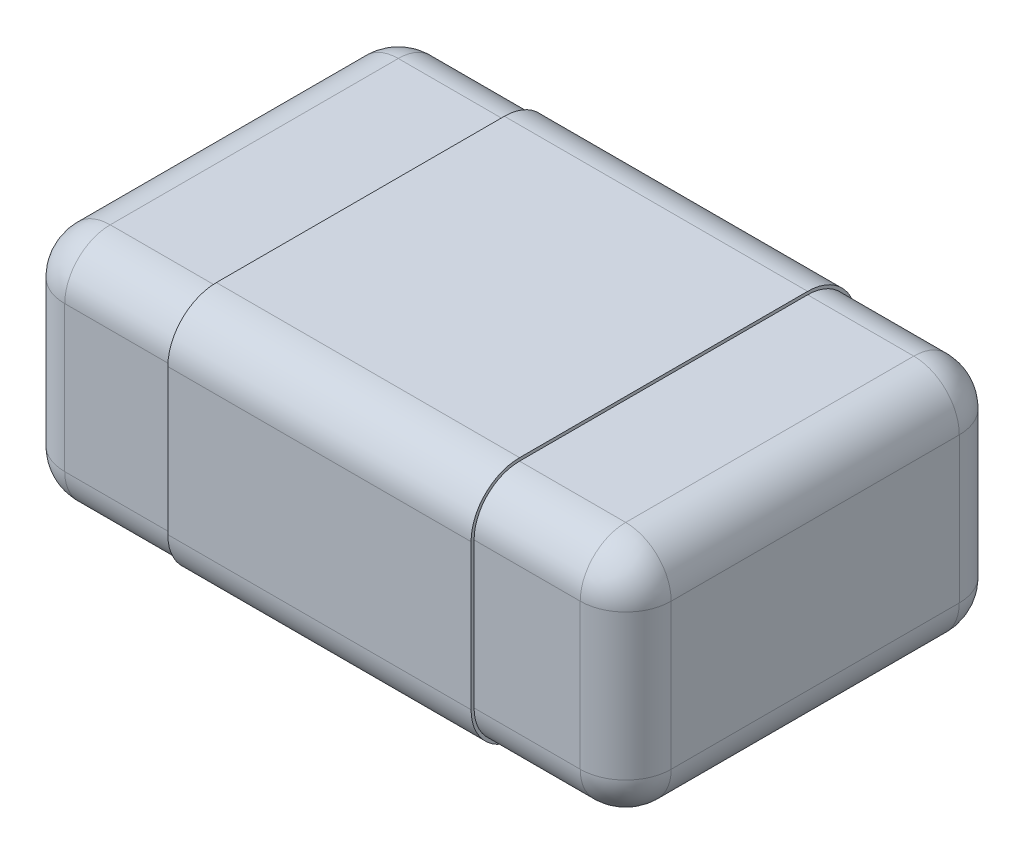
ISO-10303-21;
HEADER;
FILE_DESCRIPTION(('STEP AP214'),'2;1');
FILE_NAME('part.step','',(''),(''),'','','');
FILE_SCHEMA(('AUTOMOTIVE_DESIGN { 1 0 10303 214 1 1 1 1 }'));
ENDSEC;
DATA;
#1=APPLICATION_CONTEXT('core data for automotive mechanical design processes');
#2=APPLICATION_PROTOCOL_DEFINITION('international standard','automotive_design',2000,#1);
#3=PRODUCT_CONTEXT('',#1,'mechanical');
#4=PRODUCT('Part','Part','',(#3));
#5=PRODUCT_RELATED_PRODUCT_CATEGORY('part','',(#4));
#6=PRODUCT_DEFINITION_FORMATION('','',#4);
#7=PRODUCT_DEFINITION_CONTEXT('part definition',#1,'design');
#8=PRODUCT_DEFINITION('design','',#6,#7);
#9=PRODUCT_DEFINITION_SHAPE('','',#8);
#10=(LENGTH_UNIT() NAMED_UNIT(*) SI_UNIT(.MILLI.,.METRE.));
#11=(NAMED_UNIT(*) PLANE_ANGLE_UNIT() SI_UNIT($,.RADIAN.));
#12=(NAMED_UNIT(*) SI_UNIT($,.STERADIAN.) SOLID_ANGLE_UNIT());
#13=UNCERTAINTY_MEASURE_WITH_UNIT(LENGTH_MEASURE(1.E-05),#10,'distance_accuracy_value','');
#14=(GEOMETRIC_REPRESENTATION_CONTEXT(3) GLOBAL_UNCERTAINTY_ASSIGNED_CONTEXT((#13)) GLOBAL_UNIT_ASSIGNED_CONTEXT((#10,
#11,#12)) REPRESENTATION_CONTEXT('',''));
#15=CARTESIAN_POINT('',(0.,0.,0.));
#16=DIRECTION('',(0.,0.,1.));
#17=DIRECTION('',(1.,0.,0.));
#18=AXIS2_PLACEMENT_3D('',#15,#16,#17);
#19=CARTESIAN_POINT('',(-0.5,-0.63,-0.475));
#20=DIRECTION('',(1.,0.,0.));
#21=DIRECTION('',(0.,0.,-1.));
#22=AXIS2_PLACEMENT_3D('',#19,#20,#21);
#23=CYLINDRICAL_SURFACE('',#22,0.16);
#24=DIRECTION('',(1.,0.,0.));
#25=VECTOR('',#24,1.);
#26=CARTESIAN_POINT('',(-0.5,-0.63,-0.635));
#27=LINE('',#26,#25);
#28=CARTESIAN_POINT('',(-0.5,-0.63,-0.635));
#29=VERTEX_POINT('',#28);
#30=CARTESIAN_POINT('',(0.5,-0.63,-0.635));
#31=VERTEX_POINT('',#30);
#32=EDGE_CURVE('E324',#29,#31,#27,.T.);
#33=ORIENTED_EDGE('',*,*,#32,.T.);
#34=CARTESIAN_POINT('',(0.5,-0.63,-0.475));
#35=DIRECTION('',(1.,0.,0.));
#36=DIRECTION('',(0.,0.,-1.));
#37=AXIS2_PLACEMENT_3D('',#34,#35,#36);
#38=CIRCLE('',#37,0.16);
#39=CARTESIAN_POINT('',(0.5,-0.79,-0.475));
#40=VERTEX_POINT('',#39);
#41=EDGE_CURVE('E244',#40,#31,#38,.T.);
#42=ORIENTED_EDGE('',*,*,#41,.F.);
#43=DIRECTION('',(1.,0.,0.));
#44=VECTOR('',#43,1.);
#45=CARTESIAN_POINT('',(-0.5,-0.79,-0.475));
#46=LINE('',#45,#44);
#47=CARTESIAN_POINT('',(-0.5,-0.79,-0.475));
#48=VERTEX_POINT('',#47);
#49=EDGE_CURVE('E325',#48,#40,#46,.T.);
#50=ORIENTED_EDGE('',*,*,#49,.F.);
#51=CARTESIAN_POINT('',(-0.5,-0.63,-0.475));
#52=DIRECTION('',(1.,0.,0.));
#53=DIRECTION('',(0.,0.,-1.));
#54=AXIS2_PLACEMENT_3D('',#51,#52,#53);
#55=CIRCLE('',#54,0.16);
#56=EDGE_CURVE('E300',#48,#29,#55,.T.);
#57=ORIENTED_EDGE('',*,*,#56,.T.);
#58=EDGE_LOOP('',(#33,#42,#50,#57));
#59=FACE_BOUND('',#58,.T.);
#60=ADVANCED_FACE('F33',(#59),#23,.T.);
#61=CARTESIAN_POINT('',(-0.5,-0.79,-0.475));
#62=DIRECTION('',(0.,-1.,0.));
#63=DIRECTION('',(0.,0.,-1.));
#64=AXIS2_PLACEMENT_3D('',#61,#62,#63);
#65=PLANE('',#64);
#66=ORIENTED_EDGE('',*,*,#49,.T.);
#67=DIRECTION('',(0.,0.,-1.));
#68=VECTOR('',#67,1.);
#69=CARTESIAN_POINT('',(0.5,-0.79,-0.475));
#70=LINE('',#69,#68);
#71=CARTESIAN_POINT('',(0.5,-0.79,0.475));
#72=VERTEX_POINT('',#71);
#73=EDGE_CURVE('E281',#72,#40,#70,.T.);
#74=ORIENTED_EDGE('',*,*,#73,.F.);
#75=DIRECTION('',(1.,0.,0.));
#76=VECTOR('',#75,1.);
#77=CARTESIAN_POINT('',(-0.5,-0.79,0.475));
#78=LINE('',#77,#76);
#79=CARTESIAN_POINT('',(-0.5,-0.79,0.475));
#80=VERTEX_POINT('',#79);
#81=EDGE_CURVE('E328',#80,#72,#78,.T.);
#82=ORIENTED_EDGE('',*,*,#81,.F.);
#83=DIRECTION('',(0.,0.,-1.));
#84=VECTOR('',#83,1.);
#85=CARTESIAN_POINT('',(-0.5,-0.79,-0.475));
#86=LINE('',#85,#84);
#87=EDGE_CURVE('E321',#80,#48,#86,.T.);
#88=ORIENTED_EDGE('',*,*,#87,.T.);
#89=EDGE_LOOP('',(#66,#74,#82,#88));
#90=FACE_BOUND('',#89,.T.);
#91=ADVANCED_FACE('F554',(#90),#65,.T.);
#92=CARTESIAN_POINT('',(-0.5,-0.63,0.475));
#93=DIRECTION('',(1.,0.,0.));
#94=DIRECTION('',(0.,0.,-1.));
#95=AXIS2_PLACEMENT_3D('',#92,#93,#94);
#96=CYLINDRICAL_SURFACE('',#95,0.16);
#97=ORIENTED_EDGE('',*,*,#81,.T.);
#98=CARTESIAN_POINT('',(0.5,-0.63,0.475));
#99=DIRECTION('',(1.,0.,0.));
#100=DIRECTION('',(0.,0.,-1.));
#101=AXIS2_PLACEMENT_3D('',#98,#99,#100);
#102=CIRCLE('',#101,0.16);
#103=CARTESIAN_POINT('',(0.5,-0.63,0.635));
#104=VERTEX_POINT('',#103);
#105=EDGE_CURVE('E278',#104,#72,#102,.T.);
#106=ORIENTED_EDGE('',*,*,#105,.F.);
#107=DIRECTION('',(1.,0.,0.));
#108=VECTOR('',#107,1.);
#109=CARTESIAN_POINT('',(-0.5,-0.63,0.635));
#110=LINE('',#109,#108);
#111=CARTESIAN_POINT('',(-0.5,-0.63,0.635));
#112=VERTEX_POINT('',#111);
#113=EDGE_CURVE('E330',#112,#104,#110,.T.);
#114=ORIENTED_EDGE('',*,*,#113,.F.);
#115=CARTESIAN_POINT('',(-0.5,-0.63,0.475));
#116=DIRECTION('',(1.,0.,0.));
#117=DIRECTION('',(0.,0.,-1.));
#118=AXIS2_PLACEMENT_3D('',#115,#116,#117);
#119=CIRCLE('',#118,0.16);
#120=EDGE_CURVE('E318',#112,#80,#119,.T.);
#121=ORIENTED_EDGE('',*,*,#120,.T.);
#122=EDGE_LOOP('',(#97,#106,#114,#121));
#123=FACE_BOUND('',#122,.T.);
#124=ADVANCED_FACE('F560',(#123),#96,.T.);
#125=CARTESIAN_POINT('',(-0.5,-0.15,0.635));
#126=DIRECTION('',(0.,0.,1.));
#127=DIRECTION('',(1.,0.,0.));
#128=AXIS2_PLACEMENT_3D('',#125,#126,#127);
#129=PLANE('',#128);
#130=ORIENTED_EDGE('',*,*,#113,.T.);
#131=DIRECTION('',(0.,-1.,0.));
#132=VECTOR('',#131,1.);
#133=CARTESIAN_POINT('',(0.5,-0.15,0.635));
#134=LINE('',#133,#132);
#135=CARTESIAN_POINT('',(0.5,-0.15,0.635));
#136=VERTEX_POINT('',#135);
#137=EDGE_CURVE('E275',#136,#104,#134,.T.);
#138=ORIENTED_EDGE('',*,*,#137,.F.);
#139=DIRECTION('',(1.,0.,0.));
#140=VECTOR('',#139,1.);
#141=CARTESIAN_POINT('',(-0.5,-0.15,0.635));
#142=LINE('',#141,#140);
#143=CARTESIAN_POINT('',(-0.5,-0.15,0.635));
#144=VERTEX_POINT('',#143);
#145=EDGE_CURVE('E332',#144,#136,#142,.T.);
#146=ORIENTED_EDGE('',*,*,#145,.F.);
#147=DIRECTION('',(0.,-1.,0.));
#148=VECTOR('',#147,1.);
#149=CARTESIAN_POINT('',(-0.5,-0.15,0.635));
#150=LINE('',#149,#148);
#151=EDGE_CURVE('E315',#144,#112,#150,.T.);
#152=ORIENTED_EDGE('',*,*,#151,.T.);
#153=EDGE_LOOP('',(#130,#138,#146,#152));
#154=FACE_BOUND('',#153,.T.);
#155=ADVANCED_FACE('F664',(#154),#129,.T.);
#156=CARTESIAN_POINT('',(-0.5,-0.15,0.475));
#157=DIRECTION('',(1.,0.,0.));
#158=DIRECTION('',(0.,0.,-1.));
#159=AXIS2_PLACEMENT_3D('',#156,#157,#158);
#160=CYLINDRICAL_SURFACE('',#159,0.16);
#161=ORIENTED_EDGE('',*,*,#145,.T.);
#162=CARTESIAN_POINT('',(0.5,-0.15,0.475));
#163=DIRECTION('',(1.,0.,0.));
#164=DIRECTION('',(0.,0.,-1.));
#165=AXIS2_PLACEMENT_3D('',#162,#163,#164);
#166=CIRCLE('',#165,0.16);
#167=CARTESIAN_POINT('',(0.5,0.00999999999999981,0.475));
#168=VERTEX_POINT('',#167);
#169=EDGE_CURVE('E272',#168,#136,#166,.T.);
#170=ORIENTED_EDGE('',*,*,#169,.F.);
#171=DIRECTION('',(1.,0.,0.));
#172=VECTOR('',#171,1.);
#173=CARTESIAN_POINT('',(-0.5,0.00999999999999981,0.475));
#174=LINE('',#173,#172);
#175=CARTESIAN_POINT('',(-0.5,0.00999999999999981,0.475));
#176=VERTEX_POINT('',#175);
#177=EDGE_CURVE('E338',#176,#168,#174,.T.);
#178=ORIENTED_EDGE('',*,*,#177,.F.);
#179=CARTESIAN_POINT('',(-0.5,-0.15,0.475));
#180=DIRECTION('',(1.,0.,0.));
#181=DIRECTION('',(0.,0.,-1.));
#182=AXIS2_PLACEMENT_3D('',#179,#180,#181);
#183=CIRCLE('',#182,0.16);
#184=EDGE_CURVE('E312',#176,#144,#183,.T.);
#185=ORIENTED_EDGE('',*,*,#184,.T.);
#186=EDGE_LOOP('',(#161,#170,#178,#185));
#187=FACE_BOUND('',#186,.T.);
#188=ADVANCED_FACE('F668',(#187),#160,.T.);
#189=CARTESIAN_POINT('',(-0.5,0.00999999999999992,-0.475));
#190=DIRECTION('',(0.,1.,0.));
#191=DIRECTION('',(0.,0.,1.));
#192=AXIS2_PLACEMENT_3D('',#189,#190,#191);
#193=PLANE('',#192);
#194=ORIENTED_EDGE('',*,*,#177,.T.);
#195=DIRECTION('',(0.,0.,1.));
#196=VECTOR('',#195,1.);
#197=CARTESIAN_POINT('',(0.5,0.00999999999999992,-0.475));
#198=LINE('',#197,#196);
#199=CARTESIAN_POINT('',(0.5,0.00999999999999994,-0.475));
#200=VERTEX_POINT('',#199);
#201=EDGE_CURVE('E269',#200,#168,#198,.T.);
#202=ORIENTED_EDGE('',*,*,#201,.F.);
#203=DIRECTION('',(1.,0.,0.));
#204=VECTOR('',#203,1.);
#205=CARTESIAN_POINT('',(-0.5,0.00999999999999994,-0.475));
#206=LINE('',#205,#204);
#207=CARTESIAN_POINT('',(-0.5,0.00999999999999994,-0.475));
#208=VERTEX_POINT('',#207);
#209=EDGE_CURVE('E335',#208,#200,#206,.T.);
#210=ORIENTED_EDGE('',*,*,#209,.F.);
#211=DIRECTION('',(0.,0.,1.));
#212=VECTOR('',#211,1.);
#213=CARTESIAN_POINT('',(-0.5,0.00999999999999992,-0.475));
#214=LINE('',#213,#212);
#215=EDGE_CURVE('E309',#208,#176,#214,.T.);
#216=ORIENTED_EDGE('',*,*,#215,.T.);
#217=EDGE_LOOP('',(#194,#202,#210,#216));
#218=FACE_BOUND('',#217,.T.);
#219=ADVANCED_FACE('F672',(#218),#193,.T.);
#220=CARTESIAN_POINT('',(-0.5,-0.15,-0.475));
#221=DIRECTION('',(1.,0.,0.));
#222=DIRECTION('',(0.,0.,-1.));
#223=AXIS2_PLACEMENT_3D('',#220,#221,#222);
#224=CYLINDRICAL_SURFACE('',#223,0.16);
#225=ORIENTED_EDGE('',*,*,#209,.T.);
#226=CARTESIAN_POINT('',(0.5,-0.15,-0.475));
#227=DIRECTION('',(1.,0.,0.));
#228=DIRECTION('',(0.,0.,-1.));
#229=AXIS2_PLACEMENT_3D('',#226,#227,#228);
#230=CIRCLE('',#229,0.16);
#231=CARTESIAN_POINT('',(0.5,-0.15,-0.635));
#232=VERTEX_POINT('',#231);
#233=EDGE_CURVE('E266',#232,#200,#230,.T.);
#234=ORIENTED_EDGE('',*,*,#233,.F.);
#235=DIRECTION('',(1.,0.,0.));
#236=VECTOR('',#235,1.);
#237=CARTESIAN_POINT('',(-0.5,-0.15,-0.635));
#238=LINE('',#237,#236);
#239=CARTESIAN_POINT('',(-0.5,-0.15,-0.635));
#240=VERTEX_POINT('',#239);
#241=EDGE_CURVE('E333',#240,#232,#238,.T.);
#242=ORIENTED_EDGE('',*,*,#241,.F.);
#243=CARTESIAN_POINT('',(-0.5,-0.15,-0.475));
#244=DIRECTION('',(1.,0.,0.));
#245=DIRECTION('',(0.,0.,-1.));
#246=AXIS2_PLACEMENT_3D('',#243,#244,#245);
#247=CIRCLE('',#246,0.16);
#248=EDGE_CURVE('E306',#240,#208,#247,.T.);
#249=ORIENTED_EDGE('',*,*,#248,.T.);
#250=EDGE_LOOP('',(#225,#234,#242,#249));
#251=FACE_BOUND('',#250,.T.);
#252=ADVANCED_FACE('F675',(#251),#224,.T.);
#253=CARTESIAN_POINT('',(-0.5,-0.63,-0.635));
#254=DIRECTION('',(0.,0.,-1.));
#255=DIRECTION('',(-1.,0.,0.));
#256=AXIS2_PLACEMENT_3D('',#253,#254,#255);
#257=PLANE('',#256);
#258=ORIENTED_EDGE('',*,*,#241,.T.);
#259=DIRECTION('',(0.,1.,0.));
#260=VECTOR('',#259,1.);
#261=CARTESIAN_POINT('',(0.5,-0.63,-0.635));
#262=LINE('',#261,#260);
#263=EDGE_CURVE('E263',#31,#232,#262,.T.);
#264=ORIENTED_EDGE('',*,*,#263,.F.);
#265=ORIENTED_EDGE('',*,*,#32,.F.);
#266=DIRECTION('',(0.,1.,0.));
#267=VECTOR('',#266,1.);
#268=CARTESIAN_POINT('',(-0.5,-0.63,-0.635));
#269=LINE('',#268,#267);
#270=EDGE_CURVE('E303',#29,#240,#269,.T.);
#271=ORIENTED_EDGE('',*,*,#270,.T.);
#272=EDGE_LOOP('',(#258,#264,#265,#271));
#273=FACE_BOUND('',#272,.T.);
#274=ADVANCED_FACE('F564',(#273),#257,.T.);
#275=CARTESIAN_POINT('',(-0.5,-0.63,-0.475));
#276=DIRECTION('',(1.,0.,0.));
#277=DIRECTION('',(0.,0.,-1.));
#278=AXIS2_PLACEMENT_3D('',#275,#276,#277);
#279=PLANE('',#278);
#280=DIRECTION('',(0.,0.,-1.));
#281=VECTOR('',#280,1.);
#282=CARTESIAN_POINT('',(-0.5,-0.78,-0.475));
#283=LINE('',#282,#281);
#284=CARTESIAN_POINT('',(-0.5,-0.78,0.475));
#285=VERTEX_POINT('',#284);
#286=CARTESIAN_POINT('',(-0.5,-0.78,-0.475));
#287=VERTEX_POINT('',#286);
#288=EDGE_CURVE('E298',#285,#287,#283,.T.);
#289=ORIENTED_EDGE('',*,*,#288,.T.);
#290=CARTESIAN_POINT('',(-0.5,-0.63,-0.475));
#291=DIRECTION('',(1.,0.,0.));
#292=DIRECTION('',(0.,0.,-1.));
#293=AXIS2_PLACEMENT_3D('',#290,#291,#292);
#294=CIRCLE('',#293,0.15);
#295=CARTESIAN_POINT('',(-0.5,-0.63,-0.625));
#296=VERTEX_POINT('',#295);
#297=EDGE_CURVE('E284',#287,#296,#294,.T.);
#298=ORIENTED_EDGE('',*,*,#297,.T.);
#299=DIRECTION('',(0.,1.,0.));
#300=VECTOR('',#299,1.);
#301=CARTESIAN_POINT('',(-0.5,-0.63,-0.625));
#302=LINE('',#301,#300);
#303=CARTESIAN_POINT('',(-0.5,-0.15,-0.625));
#304=VERTEX_POINT('',#303);
#305=EDGE_CURVE('E286',#296,#304,#302,.T.);
#306=ORIENTED_EDGE('',*,*,#305,.T.);
#307=CARTESIAN_POINT('',(-0.5,-0.15,-0.475));
#308=DIRECTION('',(1.,0.,0.));
#309=DIRECTION('',(0.,0.,-1.));
#310=AXIS2_PLACEMENT_3D('',#307,#308,#309);
#311=CIRCLE('',#310,0.15);
#312=CARTESIAN_POINT('',(-0.5,0.,-0.475));
#313=VERTEX_POINT('',#312);
#314=EDGE_CURVE('E288',#304,#313,#311,.T.);
#315=ORIENTED_EDGE('',*,*,#314,.T.);
#316=DIRECTION('',(0.,0.,1.));
#317=VECTOR('',#316,1.);
#318=CARTESIAN_POINT('',(-0.5,0.,-0.475));
#319=LINE('',#318,#317);
#320=CARTESIAN_POINT('',(-0.5,0.,0.475));
#321=VERTEX_POINT('',#320);
#322=EDGE_CURVE('E290',#313,#321,#319,.T.);
#323=ORIENTED_EDGE('',*,*,#322,.T.);
#324=CARTESIAN_POINT('',(-0.5,-0.15,0.475));
#325=DIRECTION('',(1.,0.,0.));
#326=DIRECTION('',(0.,0.,-1.));
#327=AXIS2_PLACEMENT_3D('',#324,#325,#326);
#328=CIRCLE('',#327,0.15);
#329=CARTESIAN_POINT('',(-0.5,-0.15,0.625));
#330=VERTEX_POINT('',#329);
#331=EDGE_CURVE('E292',#321,#330,#328,.T.);
#332=ORIENTED_EDGE('',*,*,#331,.T.);
#333=DIRECTION('',(0.,-1.,0.));
#334=VECTOR('',#333,1.);
#335=CARTESIAN_POINT('',(-0.5,-0.15,0.625));
#336=LINE('',#335,#334);
#337=CARTESIAN_POINT('',(-0.5,-0.63,0.625));
#338=VERTEX_POINT('',#337);
#339=EDGE_CURVE('E294',#330,#338,#336,.T.);
#340=ORIENTED_EDGE('',*,*,#339,.T.);
#341=CARTESIAN_POINT('',(-0.5,-0.63,0.475));
#342=DIRECTION('',(1.,0.,0.));
#343=DIRECTION('',(0.,0.,-1.));
#344=AXIS2_PLACEMENT_3D('',#341,#342,#343);
#345=CIRCLE('',#344,0.15);
#346=EDGE_CURVE('E296',#338,#285,#345,.T.);
#347=ORIENTED_EDGE('',*,*,#346,.T.);
#348=EDGE_LOOP('',(#289,#298,#306,#315,#323,#332,#340,#347));
#349=FACE_BOUND('',#348,.T.);
#350=ORIENTED_EDGE('',*,*,#56,.F.);
#351=ORIENTED_EDGE('',*,*,#87,.F.);
#352=ORIENTED_EDGE('',*,*,#120,.F.);
#353=ORIENTED_EDGE('',*,*,#151,.F.);
#354=ORIENTED_EDGE('',*,*,#184,.F.);
#355=ORIENTED_EDGE('',*,*,#215,.F.);
#356=ORIENTED_EDGE('',*,*,#248,.F.);
#357=ORIENTED_EDGE('',*,*,#270,.F.);
#358=EDGE_LOOP('',(#350,#351,#352,#353,#354,#355,#356,#357));
#359=FACE_BOUND('',#358,.T.);
#360=ADVANCED_FACE('F504',(#349,#359),#279,.F.);
#361=CARTESIAN_POINT('',(-1.,-0.78,-0.625));
#362=DIRECTION('',(-1.,0.,0.));
#363=DIRECTION('',(0.,0.,1.));
#364=AXIS2_PLACEMENT_3D('',#361,#362,#363);
#365=PLANE('',#364);
#366=DIRECTION('',(0.,0.,1.));
#367=VECTOR('',#366,1.);
#368=CARTESIAN_POINT('',(-1.,-0.15,-0.625));
#369=LINE('',#368,#367);
#370=CARTESIAN_POINT('',(-1.,-0.15,0.475));
#371=VERTEX_POINT('',#370);
#372=CARTESIAN_POINT('',(-1.,-0.15,-0.475));
#373=VERTEX_POINT('',#372);
#374=EDGE_CURVE('E366',#371,#373,#369,.F.);
#375=ORIENTED_EDGE('',*,*,#374,.T.);
#376=DIRECTION('',(0.,1.,0.));
#377=VECTOR('',#376,1.);
#378=CARTESIAN_POINT('',(-1.,-0.78,-0.475));
#379=LINE('',#378,#377);
#380=CARTESIAN_POINT('',(-1.,-0.63,-0.475));
#381=VERTEX_POINT('',#380);
#382=EDGE_CURVE('E370',#373,#381,#379,.F.);
#383=ORIENTED_EDGE('',*,*,#382,.T.);
#384=DIRECTION('',(0.,0.,1.));
#385=VECTOR('',#384,1.);
#386=CARTESIAN_POINT('',(-1.,-0.63,0.625));
#387=LINE('',#386,#385);
#388=CARTESIAN_POINT('',(-1.,-0.63,0.475));
#389=VERTEX_POINT('',#388);
#390=EDGE_CURVE('E368',#381,#389,#387,.T.);
#391=ORIENTED_EDGE('',*,*,#390,.T.);
#392=DIRECTION('',(0.,1.,0.));
#393=VECTOR('',#392,1.);
#394=CARTESIAN_POINT('',(-1.,-0.78,0.475));
#395=LINE('',#394,#393);
#396=EDGE_CURVE('E364',#389,#371,#395,.T.);
#397=ORIENTED_EDGE('',*,*,#396,.T.);
#398=EDGE_LOOP('',(#375,#383,#391,#397));
#399=FACE_BOUND('',#398,.T.);
#400=ADVANCED_FACE('F660',(#399),#365,.T.);
#401=CARTESIAN_POINT('',(-0.85,-0.78,-0.475));
#402=DIRECTION('',(0.,1.,0.));
#403=DIRECTION('',(0.,0.,1.));
#404=AXIS2_PLACEMENT_3D('',#401,#402,#403);
#405=CYLINDRICAL_SURFACE('',#404,0.15);
#406=CARTESIAN_POINT('',(-0.85,-0.15,-0.475));
#407=DIRECTION('',(0.,1.,0.));
#408=DIRECTION('',(0.,0.,1.));
#409=AXIS2_PLACEMENT_3D('',#406,#407,#408);
#410=CIRCLE('',#409,0.15);
#411=CARTESIAN_POINT('',(-0.85,-0.15,-0.625));
#412=VERTEX_POINT('',#411);
#413=EDGE_CURVE('E448',#373,#412,#410,.F.);
#414=ORIENTED_EDGE('',*,*,#413,.T.);
#415=DIRECTION('',(0.,1.,0.));
#416=VECTOR('',#415,1.);
#417=CARTESIAN_POINT('',(-0.85,-0.78,-0.625));
#418=LINE('',#417,#416);
#419=CARTESIAN_POINT('',(-0.85,-0.63,-0.625));
#420=VERTEX_POINT('',#419);
#421=EDGE_CURVE('E353',#420,#412,#418,.T.);
#422=ORIENTED_EDGE('',*,*,#421,.F.);
#423=CARTESIAN_POINT('',(-0.85,-0.63,-0.475));
#424=DIRECTION('',(0.,-1.,0.));
#425=DIRECTION('',(0.,0.,-1.));
#426=AXIS2_PLACEMENT_3D('',#423,#424,#425);
#427=CIRCLE('',#426,0.15);
#428=EDGE_CURVE('E459',#381,#420,#427,.T.);
#429=ORIENTED_EDGE('',*,*,#428,.F.);
#430=ORIENTED_EDGE('',*,*,#382,.F.);
#431=EDGE_LOOP('',(#414,#422,#429,#430));
#432=FACE_BOUND('',#431,.T.);
#433=ADVANCED_FACE('F522',(#432),#405,.T.);
#434=CARTESIAN_POINT('',(-0.85,-0.78,0.475));
#435=DIRECTION('',(0.,1.,0.));
#436=DIRECTION('',(0.,0.,1.));
#437=AXIS2_PLACEMENT_3D('',#434,#435,#436);
#438=CYLINDRICAL_SURFACE('',#437,0.15);
#439=CARTESIAN_POINT('',(-0.85,-0.15,0.475));
#440=DIRECTION('',(0.,1.,0.));
#441=DIRECTION('',(0.,0.,1.));
#442=AXIS2_PLACEMENT_3D('',#439,#440,#441);
#443=CIRCLE('',#442,0.15);
#444=CARTESIAN_POINT('',(-0.85,-0.15,0.625));
#445=VERTEX_POINT('',#444);
#446=EDGE_CURVE('E416',#445,#371,#443,.F.);
#447=ORIENTED_EDGE('',*,*,#446,.T.);
#448=ORIENTED_EDGE('',*,*,#396,.F.);
#449=CARTESIAN_POINT('',(-0.85,-0.63,0.475));
#450=DIRECTION('',(0.,-1.,0.));
#451=DIRECTION('',(0.,0.,-1.));
#452=AXIS2_PLACEMENT_3D('',#449,#450,#451);
#453=CIRCLE('',#452,0.15);
#454=CARTESIAN_POINT('',(-0.85,-0.63,0.625));
#455=VERTEX_POINT('',#454);
#456=EDGE_CURVE('E437',#455,#389,#453,.T.);
#457=ORIENTED_EDGE('',*,*,#456,.F.);
#458=DIRECTION('',(0.,1.,0.));
#459=VECTOR('',#458,1.);
#460=CARTESIAN_POINT('',(-0.85,-0.78,0.625));
#461=LINE('',#460,#459);
#462=EDGE_CURVE('E467',#445,#455,#461,.F.);
#463=ORIENTED_EDGE('',*,*,#462,.F.);
#464=EDGE_LOOP('',(#447,#448,#457,#463));
#465=FACE_BOUND('',#464,.T.);
#466=ADVANCED_FACE('F492',(#465),#438,.T.);
#467=CARTESIAN_POINT('',(-0.85,-0.63,-0.625));
#468=DIRECTION('',(0.,0.,-1.));
#469=DIRECTION('',(-1.,0.,0.));
#470=AXIS2_PLACEMENT_3D('',#467,#468,#469);
#471=CYLINDRICAL_SURFACE('',#470,0.15);
#472=CARTESIAN_POINT('',(-0.85,-0.63,0.475));
#473=DIRECTION('',(0.,0.,1.));
#474=DIRECTION('',(0.,-1.,0.));
#475=AXIS2_PLACEMENT_3D('',#472,#473,#474);
#476=CIRCLE('',#475,0.15);
#477=CARTESIAN_POINT('',(-0.85,-0.78,0.475));
#478=VERTEX_POINT('',#477);
#479=EDGE_CURVE('E451',#478,#389,#476,.F.);
#480=ORIENTED_EDGE('',*,*,#479,.T.);
#481=ORIENTED_EDGE('',*,*,#390,.F.);
#482=CARTESIAN_POINT('',(-0.85,-0.63,-0.475));
#483=DIRECTION('',(0.,0.,-1.));
#484=DIRECTION('',(-1.,0.,0.));
#485=AXIS2_PLACEMENT_3D('',#482,#483,#484);
#486=CIRCLE('',#485,0.15);
#487=CARTESIAN_POINT('',(-0.85,-0.78,-0.475));
#488=VERTEX_POINT('',#487);
#489=EDGE_CURVE('E462',#488,#381,#486,.T.);
#490=ORIENTED_EDGE('',*,*,#489,.F.);
#491=DIRECTION('',(0.,0.,1.));
#492=VECTOR('',#491,1.);
#493=CARTESIAN_POINT('',(-0.85,-0.78,-0.625));
#494=LINE('',#493,#492);
#495=EDGE_CURVE('E234',#478,#488,#494,.F.);
#496=ORIENTED_EDGE('',*,*,#495,.F.);
#497=EDGE_LOOP('',(#480,#481,#490,#496));
#498=FACE_BOUND('',#497,.T.);
#499=ADVANCED_FACE('F590',(#498),#471,.T.);
#500=CARTESIAN_POINT('',(-0.85,-0.15,0.));
#501=DIRECTION('',(0.,0.,1.));
#502=DIRECTION('',(1.,0.,0.));
#503=AXIS2_PLACEMENT_3D('',#500,#501,#502);
#504=CYLINDRICAL_SURFACE('',#503,0.15);
#505=CARTESIAN_POINT('',(-0.85,-0.15,0.475));
#506=DIRECTION('',(0.,0.,1.));
#507=DIRECTION('',(1.,0.,0.));
#508=AXIS2_PLACEMENT_3D('',#505,#506,#507);
#509=CIRCLE('',#508,0.15);
#510=CARTESIAN_POINT('',(-0.85,0.,0.475));
#511=VERTEX_POINT('',#510);
#512=EDGE_CURVE('E413',#371,#511,#509,.F.);
#513=ORIENTED_EDGE('',*,*,#512,.T.);
#514=DIRECTION('',(0.,0.,1.));
#515=VECTOR('',#514,1.);
#516=CARTESIAN_POINT('',(-0.85,0.,0.));
#517=LINE('',#516,#515);
#518=CARTESIAN_POINT('',(-0.85,0.,-0.475));
#519=VERTEX_POINT('',#518);
#520=EDGE_CURVE('E387',#519,#511,#517,.T.);
#521=ORIENTED_EDGE('',*,*,#520,.F.);
#522=CARTESIAN_POINT('',(-0.85,-0.15,-0.475));
#523=DIRECTION('',(0.,0.,-1.));
#524=DIRECTION('',(-1.,0.,0.));
#525=AXIS2_PLACEMENT_3D('',#522,#523,#524);
#526=CIRCLE('',#525,0.15);
#527=EDGE_CURVE('E434',#373,#519,#526,.T.);
#528=ORIENTED_EDGE('',*,*,#527,.F.);
#529=ORIENTED_EDGE('',*,*,#374,.F.);
#530=EDGE_LOOP('',(#513,#521,#528,#529));
#531=FACE_BOUND('',#530,.T.);
#532=ADVANCED_FACE('F538',(#531),#504,.T.);
#533=CARTESIAN_POINT('',(-0.85,-0.15,0.475));
#534=DIRECTION('',(0.,0.,1.));
#535=DIRECTION('',(1.,0.,0.));
#536=AXIS2_PLACEMENT_3D('',#533,#534,#535);
#537=SPHERICAL_SURFACE('',#536,0.15);
#538=ORIENTED_EDGE('',*,*,#446,.F.);
#539=CARTESIAN_POINT('',(-0.85,-0.15,0.475));
#540=DIRECTION('',(-1.,0.,0.));
#541=DIRECTION('',(0.,0.,1.));
#542=AXIS2_PLACEMENT_3D('',#539,#540,#541);
#543=CIRCLE('',#542,0.15);
#544=EDGE_CURVE('E404',#445,#511,#543,.T.);
#545=ORIENTED_EDGE('',*,*,#544,.T.);
#546=ORIENTED_EDGE('',*,*,#512,.F.);
#547=EDGE_LOOP('',(#538,#545,#546));
#548=FACE_BOUND('',#547,.T.);
#549=ADVANCED_FACE('F487',(#548),#537,.T.);
#550=CARTESIAN_POINT('',(-0.85,-0.15,-0.475));
#551=DIRECTION('',(0.,0.,1.));
#552=DIRECTION('',(1.,0.,0.));
#553=AXIS2_PLACEMENT_3D('',#550,#551,#552);
#554=SPHERICAL_SURFACE('',#553,0.15);
#555=ORIENTED_EDGE('',*,*,#527,.T.);
#556=CARTESIAN_POINT('',(-0.85,-0.15,-0.475));
#557=DIRECTION('',(-1.,0.,0.));
#558=DIRECTION('',(0.,0.,1.));
#559=AXIS2_PLACEMENT_3D('',#556,#557,#558);
#560=CIRCLE('',#559,0.15);
#561=EDGE_CURVE('E431',#519,#412,#560,.T.);
#562=ORIENTED_EDGE('',*,*,#561,.T.);
#563=ORIENTED_EDGE('',*,*,#413,.F.);
#564=EDGE_LOOP('',(#555,#562,#563));
#565=FACE_BOUND('',#564,.T.);
#566=ADVANCED_FACE('F535',(#565),#554,.T.);
#567=CARTESIAN_POINT('',(-0.85,-0.63,0.475));
#568=DIRECTION('',(0.,0.,1.));
#569=DIRECTION('',(1.,0.,0.));
#570=AXIS2_PLACEMENT_3D('',#567,#568,#569);
#571=SPHERICAL_SURFACE('',#570,0.15);
#572=CARTESIAN_POINT('',(-0.85,-0.63,0.475));
#573=DIRECTION('',(-1.,0.,0.));
#574=DIRECTION('',(0.,0.,1.));
#575=AXIS2_PLACEMENT_3D('',#572,#573,#574);
#576=CIRCLE('',#575,0.15);
#577=EDGE_CURVE('E440',#478,#455,#576,.T.);
#578=ORIENTED_EDGE('',*,*,#577,.T.);
#579=ORIENTED_EDGE('',*,*,#456,.T.);
#580=ORIENTED_EDGE('',*,*,#479,.F.);
#581=EDGE_LOOP('',(#578,#579,#580));
#582=FACE_BOUND('',#581,.T.);
#583=ADVANCED_FACE('F496',(#582),#571,.T.);
#584=CARTESIAN_POINT('',(-0.85,-0.63,-0.475));
#585=DIRECTION('',(0.,0.,1.));
#586=DIRECTION('',(1.,0.,0.));
#587=AXIS2_PLACEMENT_3D('',#584,#585,#586);
#588=SPHERICAL_SURFACE('',#587,0.15);
#589=ORIENTED_EDGE('',*,*,#489,.T.);
#590=ORIENTED_EDGE('',*,*,#428,.T.);
#591=CARTESIAN_POINT('',(-0.85,-0.63,-0.475));
#592=DIRECTION('',(-1.,0.,0.));
#593=DIRECTION('',(0.,0.,1.));
#594=AXIS2_PLACEMENT_3D('',#591,#592,#593);
#595=CIRCLE('',#594,0.15);
#596=EDGE_CURVE('E327',#488,#420,#595,.F.);
#597=ORIENTED_EDGE('',*,*,#596,.F.);
#598=EDGE_LOOP('',(#589,#590,#597));
#599=FACE_BOUND('',#598,.T.);
#600=ADVANCED_FACE('F516',(#599),#588,.T.);
#601=CARTESIAN_POINT('',(0.,-0.15,-0.475));
#602=DIRECTION('',(-1.,0.,0.));
#603=DIRECTION('',(0.,0.,1.));
#604=AXIS2_PLACEMENT_3D('',#601,#602,#603);
#605=CYLINDRICAL_SURFACE('',#604,0.15);
#606=DIRECTION('',(-1.,0.,0.));
#607=VECTOR('',#606,1.);
#608=CARTESIAN_POINT('',(0.,0.,-0.475));
#609=LINE('',#608,#607);
#610=EDGE_CURVE('E389',#313,#519,#609,.T.);
#611=ORIENTED_EDGE('',*,*,#610,.F.);
#612=ORIENTED_EDGE('',*,*,#314,.F.);
#613=DIRECTION('',(-1.,0.,0.));
#614=VECTOR('',#613,1.);
#615=CARTESIAN_POINT('',(1.,-0.15,-0.625));
#616=LINE('',#615,#614);
#617=EDGE_CURVE('E347',#412,#304,#616,.F.);
#618=ORIENTED_EDGE('',*,*,#617,.F.);
#619=ORIENTED_EDGE('',*,*,#561,.F.);
#620=EDGE_LOOP('',(#611,#612,#618,#619));
#621=FACE_BOUND('',#620,.T.);
#622=ADVANCED_FACE('F532',(#621),#605,.T.);
#623=CARTESIAN_POINT('',(0.,-0.15,0.475));
#624=DIRECTION('',(1.,0.,0.));
#625=DIRECTION('',(0.,0.,-1.));
#626=AXIS2_PLACEMENT_3D('',#623,#624,#625);
#627=CYLINDRICAL_SURFACE('',#626,0.15);
#628=DIRECTION('',(1.,0.,0.));
#629=VECTOR('',#628,1.);
#630=CARTESIAN_POINT('',(-1.,-0.15,0.625));
#631=LINE('',#630,#629);
#632=EDGE_CURVE('E400',#330,#445,#631,.F.);
#633=ORIENTED_EDGE('',*,*,#632,.F.);
#634=ORIENTED_EDGE('',*,*,#331,.F.);
#635=DIRECTION('',(1.,0.,0.));
#636=VECTOR('',#635,1.);
#637=CARTESIAN_POINT('',(0.,0.,0.475));
#638=LINE('',#637,#636);
#639=EDGE_CURVE('E381',#511,#321,#638,.T.);
#640=ORIENTED_EDGE('',*,*,#639,.F.);
#641=ORIENTED_EDGE('',*,*,#544,.F.);
#642=EDGE_LOOP('',(#633,#634,#640,#641));
#643=FACE_BOUND('',#642,.T.);
#644=ADVANCED_FACE('F484',(#643),#627,.T.);
#645=CARTESIAN_POINT('',(0.,0.,0.));
#646=DIRECTION('',(0.,1.,0.));
#647=DIRECTION('',(0.,0.,1.));
#648=AXIS2_PLACEMENT_3D('',#645,#646,#647);
#649=PLANE('',#648);
#650=ORIENTED_EDGE('',*,*,#639,.T.);
#651=ORIENTED_EDGE('',*,*,#322,.F.);
#652=ORIENTED_EDGE('',*,*,#610,.T.);
#653=ORIENTED_EDGE('',*,*,#520,.T.);
#654=EDGE_LOOP('',(#650,#651,#652,#653));
#655=FACE_BOUND('',#654,.T.);
#656=ADVANCED_FACE('F540',(#655),#649,.T.);
#657=CARTESIAN_POINT('',(1.,-0.63,-0.475));
#658=DIRECTION('',(1.,0.,0.));
#659=DIRECTION('',(0.,0.,-1.));
#660=AXIS2_PLACEMENT_3D('',#657,#658,#659);
#661=CYLINDRICAL_SURFACE('',#660,0.15);
#662=DIRECTION('',(-1.,0.,0.));
#663=VECTOR('',#662,1.);
#664=CARTESIAN_POINT('',(-1.,-0.63,-0.625));
#665=LINE('',#664,#663);
#666=EDGE_CURVE('E355',#296,#420,#665,.T.);
#667=ORIENTED_EDGE('',*,*,#666,.F.);
#668=ORIENTED_EDGE('',*,*,#297,.F.);
#669=DIRECTION('',(-1.,0.,0.));
#670=VECTOR('',#669,1.);
#671=CARTESIAN_POINT('',(1.,-0.78,-0.475));
#672=LINE('',#671,#670);
#673=EDGE_CURVE('E233',#488,#287,#672,.F.);
#674=ORIENTED_EDGE('',*,*,#673,.F.);
#675=ORIENTED_EDGE('',*,*,#596,.T.);
#676=EDGE_LOOP('',(#667,#668,#674,#675));
#677=FACE_BOUND('',#676,.T.);
#678=ADVANCED_FACE('F514',(#677),#661,.T.);
#679=CARTESIAN_POINT('',(-1.,-0.63,0.475));
#680=DIRECTION('',(-1.,0.,0.));
#681=DIRECTION('',(0.,0.,1.));
#682=AXIS2_PLACEMENT_3D('',#679,#680,#681);
#683=CYLINDRICAL_SURFACE('',#682,0.15);
#684=DIRECTION('',(1.,0.,0.));
#685=VECTOR('',#684,1.);
#686=CARTESIAN_POINT('',(-1.,-0.78,0.475));
#687=LINE('',#686,#685);
#688=EDGE_CURVE('E358',#285,#478,#687,.F.);
#689=ORIENTED_EDGE('',*,*,#688,.F.);
#690=ORIENTED_EDGE('',*,*,#346,.F.);
#691=DIRECTION('',(1.,0.,0.));
#692=VECTOR('',#691,1.);
#693=CARTESIAN_POINT('',(1.,-0.63,0.625));
#694=LINE('',#693,#692);
#695=EDGE_CURVE('E11',#455,#338,#694,.T.);
#696=ORIENTED_EDGE('',*,*,#695,.F.);
#697=ORIENTED_EDGE('',*,*,#577,.F.);
#698=EDGE_LOOP('',(#689,#690,#696,#697));
#699=FACE_BOUND('',#698,.T.);
#700=ADVANCED_FACE('F500',(#699),#683,.T.);
#701=CARTESIAN_POINT('',(0.,-0.78,0.));
#702=DIRECTION('',(0.,1.,0.));
#703=DIRECTION('',(0.,0.,1.));
#704=AXIS2_PLACEMENT_3D('',#701,#702,#703);
#705=PLANE('',#704);
#706=ORIENTED_EDGE('',*,*,#288,.F.);
#707=ORIENTED_EDGE('',*,*,#688,.T.);
#708=ORIENTED_EDGE('',*,*,#495,.T.);
#709=ORIENTED_EDGE('',*,*,#673,.T.);
#710=EDGE_LOOP('',(#706,#707,#708,#709));
#711=FACE_BOUND('',#710,.T.);
#712=ADVANCED_FACE('F508',(#711),#705,.F.);
#713=CARTESIAN_POINT('',(-1.,-0.78,0.625));
#714=DIRECTION('',(0.,0.,1.));
#715=DIRECTION('',(1.,0.,0.));
#716=AXIS2_PLACEMENT_3D('',#713,#714,#715);
#717=PLANE('',#716);
#718=ORIENTED_EDGE('',*,*,#695,.T.);
#719=ORIENTED_EDGE('',*,*,#339,.F.);
#720=ORIENTED_EDGE('',*,*,#632,.T.);
#721=ORIENTED_EDGE('',*,*,#462,.T.);
#722=EDGE_LOOP('',(#718,#719,#720,#721));
#723=FACE_BOUND('',#722,.T.);
#724=ADVANCED_FACE('F477',(#723),#717,.T.);
#725=CARTESIAN_POINT('',(1.,-0.78,-0.625));
#726=DIRECTION('',(0.,0.,-1.));
#727=DIRECTION('',(-1.,0.,0.));
#728=AXIS2_PLACEMENT_3D('',#725,#726,#727);
#729=PLANE('',#728);
#730=ORIENTED_EDGE('',*,*,#617,.T.);
#731=ORIENTED_EDGE('',*,*,#305,.F.);
#732=ORIENTED_EDGE('',*,*,#666,.T.);
#733=ORIENTED_EDGE('',*,*,#421,.T.);
#734=EDGE_LOOP('',(#730,#731,#732,#733));
#735=FACE_BOUND('',#734,.T.);
#736=ADVANCED_FACE('F526',(#735),#729,.T.);
#737=CARTESIAN_POINT('',(0.5,-0.63,-0.475));
#738=DIRECTION('',(1.,0.,0.));
#739=DIRECTION('',(0.,0.,-1.));
#740=AXIS2_PLACEMENT_3D('',#737,#738,#739);
#741=PLANE('',#740);
#742=ORIENTED_EDGE('',*,*,#41,.T.);
#743=ORIENTED_EDGE('',*,*,#263,.T.);
#744=ORIENTED_EDGE('',*,*,#233,.T.);
#745=ORIENTED_EDGE('',*,*,#201,.T.);
#746=ORIENTED_EDGE('',*,*,#169,.T.);
#747=ORIENTED_EDGE('',*,*,#137,.T.);
#748=ORIENTED_EDGE('',*,*,#105,.T.);
#749=ORIENTED_EDGE('',*,*,#73,.T.);
#750=EDGE_LOOP('',(#742,#743,#744,#745,#746,#747,#748,#749));
#751=FACE_BOUND('',#750,.T.);
#752=DIRECTION('',(0.,1.,0.));
#753=VECTOR('',#752,1.);
#754=CARTESIAN_POINT('',(0.5,-0.63,-0.625));
#755=LINE('',#754,#753);
#756=CARTESIAN_POINT('',(0.5,-0.63,-0.625));
#757=VERTEX_POINT('',#756);
#758=CARTESIAN_POINT('',(0.5,-0.15,-0.625));
#759=VERTEX_POINT('',#758);
#760=EDGE_CURVE('E250',#757,#759,#755,.T.);
#761=ORIENTED_EDGE('',*,*,#760,.F.);
#762=CARTESIAN_POINT('',(0.5,-0.63,-0.475));
#763=DIRECTION('',(1.,0.,0.));
#764=DIRECTION('',(0.,0.,-1.));
#765=AXIS2_PLACEMENT_3D('',#762,#763,#764);
#766=CIRCLE('',#765,0.15);
#767=CARTESIAN_POINT('',(0.5,-0.78,-0.475));
#768=VERTEX_POINT('',#767);
#769=EDGE_CURVE('E227',#768,#757,#766,.T.);
#770=ORIENTED_EDGE('',*,*,#769,.F.);
#771=DIRECTION('',(0.,0.,-1.));
#772=VECTOR('',#771,1.);
#773=CARTESIAN_POINT('',(0.5,-0.78,-0.475));
#774=LINE('',#773,#772);
#775=CARTESIAN_POINT('',(0.5,-0.78,0.475));
#776=VERTEX_POINT('',#775);
#777=EDGE_CURVE('E238',#776,#768,#774,.T.);
#778=ORIENTED_EDGE('',*,*,#777,.F.);
#779=CARTESIAN_POINT('',(0.5,-0.63,0.475));
#780=DIRECTION('',(1.,0.,0.));
#781=DIRECTION('',(0.,0.,-1.));
#782=AXIS2_PLACEMENT_3D('',#779,#780,#781);
#783=CIRCLE('',#782,0.15);
#784=CARTESIAN_POINT('',(0.5,-0.63,0.625));
#785=VERTEX_POINT('',#784);
#786=EDGE_CURVE('E245',#785,#776,#783,.T.);
#787=ORIENTED_EDGE('',*,*,#786,.F.);
#788=DIRECTION('',(0.,-1.,0.));
#789=VECTOR('',#788,1.);
#790=CARTESIAN_POINT('',(0.5,-0.15,0.625));
#791=LINE('',#790,#789);
#792=CARTESIAN_POINT('',(0.5,-0.15,0.625));
#793=VERTEX_POINT('',#792);
#794=EDGE_CURVE('E258',#793,#785,#791,.T.);
#795=ORIENTED_EDGE('',*,*,#794,.F.);
#796=CARTESIAN_POINT('',(0.5,-0.15,0.475));
#797=DIRECTION('',(1.,0.,0.));
#798=DIRECTION('',(0.,0.,-1.));
#799=AXIS2_PLACEMENT_3D('',#796,#797,#798);
#800=CIRCLE('',#799,0.15);
#801=CARTESIAN_POINT('',(0.5,0.,0.475));
#802=VERTEX_POINT('',#801);
#803=EDGE_CURVE('E51',#802,#793,#800,.T.);
#804=ORIENTED_EDGE('',*,*,#803,.F.);
#805=DIRECTION('',(0.,0.,1.));
#806=VECTOR('',#805,1.);
#807=CARTESIAN_POINT('',(0.5,0.,-0.475));
#808=LINE('',#807,#806);
#809=CARTESIAN_POINT('',(0.5,0.,-0.475));
#810=VERTEX_POINT('',#809);
#811=EDGE_CURVE('E59',#810,#802,#808,.T.);
#812=ORIENTED_EDGE('',*,*,#811,.F.);
#813=CARTESIAN_POINT('',(0.5,-0.15,-0.475));
#814=DIRECTION('',(1.,0.,0.));
#815=DIRECTION('',(0.,0.,-1.));
#816=AXIS2_PLACEMENT_3D('',#813,#814,#815);
#817=CIRCLE('',#816,0.15);
#818=EDGE_CURVE('E252',#759,#810,#817,.T.);
#819=ORIENTED_EDGE('',*,*,#818,.F.);
#820=EDGE_LOOP('',(#761,#770,#778,#787,#795,#804,#812,#819));
#821=FACE_BOUND('',#820,.T.);
#822=ADVANCED_FACE('F248',(#751,#821),#741,.T.);
#823=CARTESIAN_POINT('',(1.,-0.78,0.625));
#824=DIRECTION('',(1.,0.,0.));
#825=DIRECTION('',(0.,0.,-1.));
#826=AXIS2_PLACEMENT_3D('',#823,#824,#825);
#827=PLANE('',#826);
#828=DIRECTION('',(0.,0.,-1.));
#829=VECTOR('',#828,1.);
#830=CARTESIAN_POINT('',(1.,-0.63,-0.625));
#831=LINE('',#830,#829);
#832=CARTESIAN_POINT('',(1.,-0.63,0.475));
#833=VERTEX_POINT('',#832);
#834=CARTESIAN_POINT('',(1.,-0.63,-0.475));
#835=VERTEX_POINT('',#834);
#836=EDGE_CURVE('E377',#833,#835,#831,.T.);
#837=ORIENTED_EDGE('',*,*,#836,.T.);
#838=DIRECTION('',(0.,1.,0.));
#839=VECTOR('',#838,1.);
#840=CARTESIAN_POINT('',(1.,-0.78,-0.475));
#841=LINE('',#840,#839);
#842=CARTESIAN_POINT('',(1.,-0.15,-0.475));
#843=VERTEX_POINT('',#842);
#844=EDGE_CURVE('E379',#835,#843,#841,.T.);
#845=ORIENTED_EDGE('',*,*,#844,.T.);
#846=DIRECTION('',(0.,0.,-1.));
#847=VECTOR('',#846,1.);
#848=CARTESIAN_POINT('',(1.,-0.15,0.625));
#849=LINE('',#848,#847);
#850=CARTESIAN_POINT('',(1.,-0.15,0.475));
#851=VERTEX_POINT('',#850);
#852=EDGE_CURVE('E375',#843,#851,#849,.F.);
#853=ORIENTED_EDGE('',*,*,#852,.T.);
#854=DIRECTION('',(0.,1.,0.));
#855=VECTOR('',#854,1.);
#856=CARTESIAN_POINT('',(1.,-0.78,0.475));
#857=LINE('',#856,#855);
#858=EDGE_CURVE('E373',#851,#833,#857,.F.);
#859=ORIENTED_EDGE('',*,*,#858,.T.);
#860=EDGE_LOOP('',(#837,#845,#853,#859));
#861=FACE_BOUND('',#860,.T.);
#862=ADVANCED_FACE('F634',(#861),#827,.T.);
#863=CARTESIAN_POINT('',(0.85,-0.78,-0.475));
#864=DIRECTION('',(0.,1.,0.));
#865=DIRECTION('',(0.,0.,1.));
#866=AXIS2_PLACEMENT_3D('',#863,#864,#865);
#867=CYLINDRICAL_SURFACE('',#866,0.15);
#868=CARTESIAN_POINT('',(0.85,-0.15,-0.475));
#869=DIRECTION('',(0.,1.,0.));
#870=DIRECTION('',(0.,0.,1.));
#871=AXIS2_PLACEMENT_3D('',#868,#869,#870);
#872=CIRCLE('',#871,0.15);
#873=CARTESIAN_POINT('',(0.85,-0.15,-0.625));
#874=VERTEX_POINT('',#873);
#875=EDGE_CURVE('E446',#874,#843,#872,.F.);
#876=ORIENTED_EDGE('',*,*,#875,.T.);
#877=ORIENTED_EDGE('',*,*,#844,.F.);
#878=CARTESIAN_POINT('',(0.85,-0.63,-0.475));
#879=DIRECTION('',(0.,-1.,0.));
#880=DIRECTION('',(0.,0.,-1.));
#881=AXIS2_PLACEMENT_3D('',#878,#879,#880);
#882=CIRCLE('',#881,0.15);
#883=CARTESIAN_POINT('',(0.85,-0.63,-0.625));
#884=VERTEX_POINT('',#883);
#885=EDGE_CURVE('E456',#884,#835,#882,.T.);
#886=ORIENTED_EDGE('',*,*,#885,.F.);
#887=DIRECTION('',(0.,1.,0.));
#888=VECTOR('',#887,1.);
#889=CARTESIAN_POINT('',(0.85,-0.78,-0.625));
#890=LINE('',#889,#888);
#891=EDGE_CURVE('E350',#874,#884,#890,.F.);
#892=ORIENTED_EDGE('',*,*,#891,.F.);
#893=EDGE_LOOP('',(#876,#877,#886,#892));
#894=FACE_BOUND('',#893,.T.);
#895=ADVANCED_FACE('F607',(#894),#867,.T.);
#896=CARTESIAN_POINT('',(0.85,-0.78,0.475));
#897=DIRECTION('',(0.,1.,0.));
#898=DIRECTION('',(0.,0.,1.));
#899=AXIS2_PLACEMENT_3D('',#896,#897,#898);
#900=CYLINDRICAL_SURFACE('',#899,0.15);
#901=CARTESIAN_POINT('',(0.85,-0.15,0.475));
#902=DIRECTION('',(0.,1.,0.));
#903=DIRECTION('',(0.,0.,1.));
#904=AXIS2_PLACEMENT_3D('',#901,#902,#903);
#905=CIRCLE('',#904,0.15);
#906=CARTESIAN_POINT('',(0.85,-0.15,0.625));
#907=VERTEX_POINT('',#906);
#908=EDGE_CURVE('E407',#851,#907,#905,.F.);
#909=ORIENTED_EDGE('',*,*,#908,.T.);
#910=DIRECTION('',(0.,1.,0.));
#911=VECTOR('',#910,1.);
#912=CARTESIAN_POINT('',(0.85,-0.78,0.625));
#913=LINE('',#912,#911);
#914=CARTESIAN_POINT('',(0.85,-0.63,0.625));
#915=VERTEX_POINT('',#914);
#916=EDGE_CURVE('E468',#915,#907,#913,.T.);
#917=ORIENTED_EDGE('',*,*,#916,.F.);
#918=CARTESIAN_POINT('',(0.85,-0.63,0.475));
#919=DIRECTION('',(0.,-1.,0.));
#920=DIRECTION('',(0.,0.,-1.));
#921=AXIS2_PLACEMENT_3D('',#918,#919,#920);
#922=CIRCLE('',#921,0.15);
#923=EDGE_CURVE('E422',#833,#915,#922,.T.);
#924=ORIENTED_EDGE('',*,*,#923,.F.);
#925=ORIENTED_EDGE('',*,*,#858,.F.);
#926=EDGE_LOOP('',(#909,#917,#924,#925));
#927=FACE_BOUND('',#926,.T.);
#928=ADVANCED_FACE('F604',(#927),#900,.T.);
#929=CARTESIAN_POINT('',(0.85,-0.63,0.625));
#930=DIRECTION('',(0.,0.,1.));
#931=DIRECTION('',(1.,0.,0.));
#932=AXIS2_PLACEMENT_3D('',#929,#930,#931);
#933=CYLINDRICAL_SURFACE('',#932,0.15);
#934=CARTESIAN_POINT('',(0.85,-0.63,0.475));
#935=DIRECTION('',(0.,0.,1.));
#936=DIRECTION('',(1.,0.,0.));
#937=AXIS2_PLACEMENT_3D('',#934,#935,#936);
#938=CIRCLE('',#937,0.15);
#939=CARTESIAN_POINT('',(0.85,-0.78,0.475));
#940=VERTEX_POINT('',#939);
#941=EDGE_CURVE('E443',#833,#940,#938,.F.);
#942=ORIENTED_EDGE('',*,*,#941,.T.);
#943=DIRECTION('',(0.,0.,-1.));
#944=VECTOR('',#943,1.);
#945=CARTESIAN_POINT('',(0.85,-0.78,0.625));
#946=LINE('',#945,#944);
#947=CARTESIAN_POINT('',(0.85,-0.78,-0.475));
#948=VERTEX_POINT('',#947);
#949=EDGE_CURVE('E360',#948,#940,#946,.F.);
#950=ORIENTED_EDGE('',*,*,#949,.F.);
#951=CARTESIAN_POINT('',(0.85,-0.63,-0.475));
#952=DIRECTION('',(0.,0.,-1.));
#953=DIRECTION('',(0.,1.,0.));
#954=AXIS2_PLACEMENT_3D('',#951,#952,#953);
#955=CIRCLE('',#954,0.15);
#956=EDGE_CURVE('E454',#835,#948,#955,.T.);
#957=ORIENTED_EDGE('',*,*,#956,.F.);
#958=ORIENTED_EDGE('',*,*,#836,.F.);
#959=EDGE_LOOP('',(#942,#950,#957,#958));
#960=FACE_BOUND('',#959,.T.);
#961=ADVANCED_FACE('F602',(#960),#933,.T.);
#962=CARTESIAN_POINT('',(0.85,-0.15,0.));
#963=DIRECTION('',(0.,0.,-1.));
#964=DIRECTION('',(-1.,0.,0.));
#965=AXIS2_PLACEMENT_3D('',#962,#963,#964);
#966=CYLINDRICAL_SURFACE('',#965,0.15);
#967=CARTESIAN_POINT('',(0.85,-0.15,0.475));
#968=DIRECTION('',(0.,0.,1.));
#969=DIRECTION('',(1.,0.,0.));
#970=AXIS2_PLACEMENT_3D('',#967,#968,#969);
#971=CIRCLE('',#970,0.15);
#972=CARTESIAN_POINT('',(0.85,0.,0.475));
#973=VERTEX_POINT('',#972);
#974=EDGE_CURVE('E410',#973,#851,#971,.F.);
#975=ORIENTED_EDGE('',*,*,#974,.T.);
#976=ORIENTED_EDGE('',*,*,#852,.F.);
#977=CARTESIAN_POINT('',(0.85,-0.15,-0.475));
#978=DIRECTION('',(0.,0.,-1.));
#979=DIRECTION('',(-1.,0.,0.));
#980=AXIS2_PLACEMENT_3D('',#977,#978,#979);
#981=CIRCLE('',#980,0.15);
#982=CARTESIAN_POINT('',(0.85,0.,-0.475));
#983=VERTEX_POINT('',#982);
#984=EDGE_CURVE('E425',#983,#843,#981,.T.);
#985=ORIENTED_EDGE('',*,*,#984,.F.);
#986=DIRECTION('',(0.,0.,-1.));
#987=VECTOR('',#986,1.);
#988=CARTESIAN_POINT('',(0.85,0.,0.));
#989=LINE('',#988,#987);
#990=EDGE_CURVE('E385',#973,#983,#989,.T.);
#991=ORIENTED_EDGE('',*,*,#990,.F.);
#992=EDGE_LOOP('',(#975,#976,#985,#991));
#993=FACE_BOUND('',#992,.T.);
#994=ADVANCED_FACE('F598',(#993),#966,.T.);
#995=CARTESIAN_POINT('',(0.85,-0.15,0.475));
#996=DIRECTION('',(0.,0.,1.));
#997=DIRECTION('',(1.,0.,0.));
#998=AXIS2_PLACEMENT_3D('',#995,#996,#997);
#999=SPHERICAL_SURFACE('',#998,0.15);
#1000=ORIENTED_EDGE('',*,*,#974,.F.);
#1001=CARTESIAN_POINT('',(0.85,-0.15,0.475));
#1002=DIRECTION('',(1.,0.,0.));
#1003=DIRECTION('',(0.,0.,-1.));
#1004=AXIS2_PLACEMENT_3D('',#1001,#1002,#1003);
#1005=CIRCLE('',#1004,0.15);
#1006=EDGE_CURVE('E401',#973,#907,#1005,.T.);
#1007=ORIENTED_EDGE('',*,*,#1006,.T.);
#1008=ORIENTED_EDGE('',*,*,#908,.F.);
#1009=EDGE_LOOP('',(#1000,#1007,#1008));
#1010=FACE_BOUND('',#1009,.T.);
#1011=ADVANCED_FACE('F601',(#1010),#999,.T.);
#1012=CARTESIAN_POINT('',(0.85,-0.15,-0.475));
#1013=DIRECTION('',(0.,0.,1.));
#1014=DIRECTION('',(1.,0.,0.));
#1015=AXIS2_PLACEMENT_3D('',#1012,#1013,#1014);
#1016=SPHERICAL_SURFACE('',#1015,0.15);
#1017=CARTESIAN_POINT('',(0.85,-0.15,-0.475));
#1018=DIRECTION('',(1.,0.,0.));
#1019=DIRECTION('',(0.,0.,-1.));
#1020=AXIS2_PLACEMENT_3D('',#1017,#1018,#1019);
#1021=CIRCLE('',#1020,0.15);
#1022=EDGE_CURVE('E428',#874,#983,#1021,.T.);
#1023=ORIENTED_EDGE('',*,*,#1022,.T.);
#1024=ORIENTED_EDGE('',*,*,#984,.T.);
#1025=ORIENTED_EDGE('',*,*,#875,.F.);
#1026=EDGE_LOOP('',(#1023,#1024,#1025));
#1027=FACE_BOUND('',#1026,.T.);
#1028=ADVANCED_FACE('F611',(#1027),#1016,.T.);
#1029=CARTESIAN_POINT('',(0.85,-0.63,0.475));
#1030=DIRECTION('',(0.,0.,1.));
#1031=DIRECTION('',(1.,0.,0.));
#1032=AXIS2_PLACEMENT_3D('',#1029,#1030,#1031);
#1033=SPHERICAL_SURFACE('',#1032,0.15);
#1034=ORIENTED_EDGE('',*,*,#923,.T.);
#1035=CARTESIAN_POINT('',(0.85,-0.63,0.475));
#1036=DIRECTION('',(1.,0.,0.));
#1037=DIRECTION('',(0.,0.,-1.));
#1038=AXIS2_PLACEMENT_3D('',#1035,#1036,#1037);
#1039=CIRCLE('',#1038,0.15);
#1040=EDGE_CURVE('E419',#915,#940,#1039,.T.);
#1041=ORIENTED_EDGE('',*,*,#1040,.T.);
#1042=ORIENTED_EDGE('',*,*,#941,.F.);
#1043=EDGE_LOOP('',(#1034,#1041,#1042));
#1044=FACE_BOUND('',#1043,.T.);
#1045=ADVANCED_FACE('F586',(#1044),#1033,.T.);
#1046=CARTESIAN_POINT('',(0.85,-0.63,-0.475));
#1047=DIRECTION('',(0.,0.,1.));
#1048=DIRECTION('',(1.,0.,0.));
#1049=AXIS2_PLACEMENT_3D('',#1046,#1047,#1048);
#1050=SPHERICAL_SURFACE('',#1049,0.15);
#1051=ORIENTED_EDGE('',*,*,#885,.T.);
#1052=ORIENTED_EDGE('',*,*,#956,.T.);
#1053=CARTESIAN_POINT('',(0.85,-0.63,-0.475));
#1054=DIRECTION('',(1.,0.,0.));
#1055=DIRECTION('',(0.,0.,-1.));
#1056=AXIS2_PLACEMENT_3D('',#1053,#1054,#1055);
#1057=CIRCLE('',#1056,0.15);
#1058=EDGE_CURVE('E230',#884,#948,#1057,.F.);
#1059=ORIENTED_EDGE('',*,*,#1058,.F.);
#1060=EDGE_LOOP('',(#1051,#1052,#1059));
#1061=FACE_BOUND('',#1060,.T.);
#1062=ADVANCED_FACE('F596',(#1061),#1050,.T.);
#1063=ORIENTED_EDGE('',*,*,#818,.T.);
#1064=EDGE_CURVE('E398',#983,#810,#609,.T.);
#1065=ORIENTED_EDGE('',*,*,#1064,.F.);
#1066=ORIENTED_EDGE('',*,*,#1022,.F.);
#1067=EDGE_CURVE('E351',#759,#874,#616,.F.);
#1068=ORIENTED_EDGE('',*,*,#1067,.F.);
#1069=EDGE_LOOP('',(#1063,#1065,#1066,#1068));
#1070=FACE_BOUND('',#1069,.T.);
#1071=ADVANCED_FACE('F593',(#1070),#605,.T.);
#1072=ORIENTED_EDGE('',*,*,#803,.T.);
#1073=EDGE_CURVE('E469',#907,#793,#631,.F.);
#1074=ORIENTED_EDGE('',*,*,#1073,.F.);
#1075=ORIENTED_EDGE('',*,*,#1006,.F.);
#1076=EDGE_CURVE('E37',#802,#973,#638,.T.);
#1077=ORIENTED_EDGE('',*,*,#1076,.F.);
#1078=EDGE_LOOP('',(#1072,#1074,#1075,#1077));
#1079=FACE_BOUND('',#1078,.T.);
#1080=ADVANCED_FACE('F35',(#1079),#627,.T.);
#1081=ORIENTED_EDGE('',*,*,#811,.T.);
#1082=ORIENTED_EDGE('',*,*,#1076,.T.);
#1083=ORIENTED_EDGE('',*,*,#990,.T.);
#1084=ORIENTED_EDGE('',*,*,#1064,.T.);
#1085=EDGE_LOOP('',(#1081,#1082,#1083,#1084));
#1086=FACE_BOUND('',#1085,.T.);
#1087=ADVANCED_FACE('F544',(#1086),#649,.T.);
#1088=ORIENTED_EDGE('',*,*,#769,.T.);
#1089=EDGE_CURVE('E356',#884,#757,#665,.T.);
#1090=ORIENTED_EDGE('',*,*,#1089,.F.);
#1091=ORIENTED_EDGE('',*,*,#1058,.T.);
#1092=EDGE_CURVE('E222',#768,#948,#672,.F.);
#1093=ORIENTED_EDGE('',*,*,#1092,.F.);
#1094=EDGE_LOOP('',(#1088,#1090,#1091,#1093));
#1095=FACE_BOUND('',#1094,.T.);
#1096=ADVANCED_FACE('F224',(#1095),#661,.T.);
#1097=ORIENTED_EDGE('',*,*,#786,.T.);
#1098=EDGE_CURVE('E241',#940,#776,#687,.F.);
#1099=ORIENTED_EDGE('',*,*,#1098,.F.);
#1100=ORIENTED_EDGE('',*,*,#1040,.F.);
#1101=EDGE_CURVE('E43',#785,#915,#694,.T.);
#1102=ORIENTED_EDGE('',*,*,#1101,.F.);
#1103=EDGE_LOOP('',(#1097,#1099,#1100,#1102));
#1104=FACE_BOUND('',#1103,.T.);
#1105=ADVANCED_FACE('F568',(#1104),#683,.T.);
#1106=ORIENTED_EDGE('',*,*,#1098,.T.);
#1107=ORIENTED_EDGE('',*,*,#777,.T.);
#1108=ORIENTED_EDGE('',*,*,#1092,.T.);
#1109=ORIENTED_EDGE('',*,*,#949,.T.);
#1110=EDGE_LOOP('',(#1106,#1107,#1108,#1109));
#1111=FACE_BOUND('',#1110,.T.);
#1112=ADVANCED_FACE('F239',(#1111),#705,.F.);
#1113=ORIENTED_EDGE('',*,*,#794,.T.);
#1114=ORIENTED_EDGE('',*,*,#1101,.T.);
#1115=ORIENTED_EDGE('',*,*,#916,.T.);
#1116=ORIENTED_EDGE('',*,*,#1073,.T.);
#1117=EDGE_LOOP('',(#1113,#1114,#1115,#1116));
#1118=FACE_BOUND('',#1117,.T.);
#1119=ADVANCED_FACE('F567',(#1118),#717,.T.);
#1120=ORIENTED_EDGE('',*,*,#760,.T.);
#1121=ORIENTED_EDGE('',*,*,#1067,.T.);
#1122=ORIENTED_EDGE('',*,*,#891,.T.);
#1123=ORIENTED_EDGE('',*,*,#1089,.T.);
#1124=EDGE_LOOP('',(#1120,#1121,#1122,#1123));
#1125=FACE_BOUND('',#1124,.T.);
#1126=ADVANCED_FACE('F573',(#1125),#729,.T.);
#1127=CLOSED_SHELL('',(#60,#91,#124,#155,#188,#219,#252,#274,#360,#400,#433,#466,#499,#532,#549,
#566,#583,#600,#622,#644,#656,#678,#700,#712,#724,#736,#822,#862,#895,#928,#961,#994,#1011,
#1028,#1045,#1062,#1071,#1080,#1087,#1096,#1105,#1112,#1119,#1126));
#1128=MANIFOLD_SOLID_BREP('B2',#1127);
#1129=ADVANCED_BREP_SHAPE_REPRESENTATION('',(#18,#1128),#14);
#1130=SHAPE_DEFINITION_REPRESENTATION(#9,#1129);
ENDSEC;
END-ISO-10303-21;
